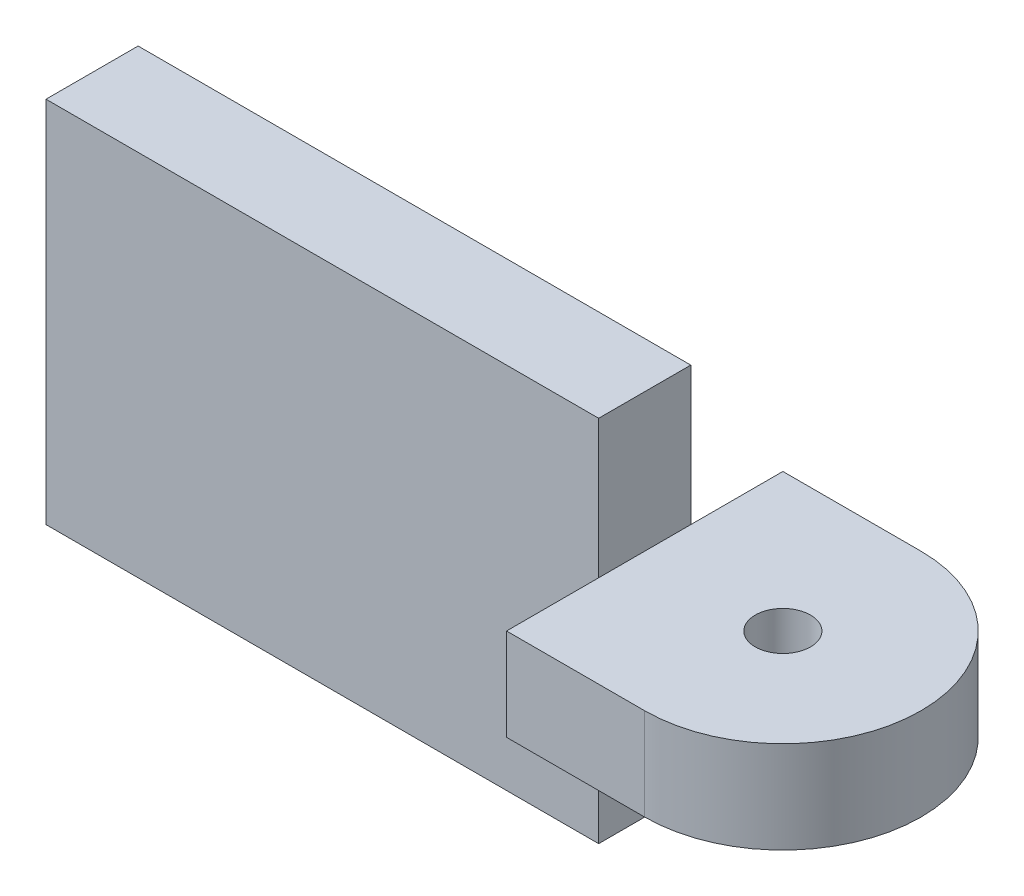
ISO-10303-21;
HEADER;
FILE_DESCRIPTION(('STEP AP214'),'2;1');
FILE_NAME('part.step','',(''),(''),'','','');
FILE_SCHEMA(('AUTOMOTIVE_DESIGN { 1 0 10303 214 1 1 1 1 }'));
ENDSEC;
DATA;
#1=APPLICATION_CONTEXT('core data for automotive mechanical design processes');
#2=APPLICATION_PROTOCOL_DEFINITION('international standard','automotive_design',2000,#1);
#3=PRODUCT_CONTEXT('',#1,'mechanical');
#4=PRODUCT('Part','Part','',(#3));
#5=PRODUCT_RELATED_PRODUCT_CATEGORY('part','',(#4));
#6=PRODUCT_DEFINITION_FORMATION('','',#4);
#7=PRODUCT_DEFINITION_CONTEXT('part definition',#1,'design');
#8=PRODUCT_DEFINITION('design','',#6,#7);
#9=PRODUCT_DEFINITION_SHAPE('','',#8);
#10=(LENGTH_UNIT() NAMED_UNIT(*) SI_UNIT(.MILLI.,.METRE.));
#11=(NAMED_UNIT(*) PLANE_ANGLE_UNIT() SI_UNIT($,.RADIAN.));
#12=(NAMED_UNIT(*) SI_UNIT($,.STERADIAN.) SOLID_ANGLE_UNIT());
#13=UNCERTAINTY_MEASURE_WITH_UNIT(LENGTH_MEASURE(1.E-05),#10,'distance_accuracy_value','');
#14=(GEOMETRIC_REPRESENTATION_CONTEXT(3) GLOBAL_UNCERTAINTY_ASSIGNED_CONTEXT((#13)) GLOBAL_UNIT_ASSIGNED_CONTEXT((#10,
#11,#12)) REPRESENTATION_CONTEXT('',''));
#15=CARTESIAN_POINT('',(0.,0.,0.));
#16=DIRECTION('',(0.,0.,1.));
#17=DIRECTION('',(1.,0.,0.));
#18=AXIS2_PLACEMENT_3D('',#15,#16,#17);
#19=CARTESIAN_POINT('',(7.5,7.5,2.5));
#20=DIRECTION('',(0.,-1.,0.));
#21=DIRECTION('',(1.,0.,0.));
#22=AXIS2_PLACEMENT_3D('',#19,#20,#21);
#23=CYLINDRICAL_SURFACE('',#22,7.5);
#24=DIRECTION('',(0.,-1.,0.));
#25=VECTOR('',#24,1.);
#26=CARTESIAN_POINT('',(7.5,7.5,10.));
#27=LINE('',#26,#25);
#28=CARTESIAN_POINT('',(7.5,7.5,10.));
#29=VERTEX_POINT('',#28);
#30=CARTESIAN_POINT('',(7.5,12.5,10.));
#31=VERTEX_POINT('',#30);
#32=EDGE_CURVE('E96',#29,#31,#27,.F.);
#33=ORIENTED_EDGE('',*,*,#32,.F.);
#34=CARTESIAN_POINT('',(7.5,7.5,2.5));
#35=DIRECTION('',(0.,1.,0.));
#36=DIRECTION('',(-1.,0.,0.));
#37=AXIS2_PLACEMENT_3D('',#34,#35,#36);
#38=CIRCLE('',#37,7.5);
#39=CARTESIAN_POINT('',(7.5,7.5,-5.));
#40=VERTEX_POINT('',#39);
#41=EDGE_CURVE('E57',#40,#29,#38,.F.);
#42=ORIENTED_EDGE('',*,*,#41,.F.);
#43=DIRECTION('',(0.,-1.,0.));
#44=VECTOR('',#43,1.);
#45=CARTESIAN_POINT('',(7.5,7.5,-5.));
#46=LINE('',#45,#44);
#47=CARTESIAN_POINT('',(7.5,12.5,-5.));
#48=VERTEX_POINT('',#47);
#49=EDGE_CURVE('E125',#48,#40,#46,.T.);
#50=ORIENTED_EDGE('',*,*,#49,.F.);
#51=CARTESIAN_POINT('',(7.5,12.5,2.5));
#52=DIRECTION('',(0.,-1.,0.));
#53=DIRECTION('',(1.,0.,0.));
#54=AXIS2_PLACEMENT_3D('',#51,#52,#53);
#55=CIRCLE('',#54,7.5);
#56=EDGE_CURVE('E12',#31,#48,#55,.F.);
#57=ORIENTED_EDGE('',*,*,#56,.F.);
#58=EDGE_LOOP('',(#33,#42,#50,#57));
#59=FACE_BOUND('',#58,.T.);
#60=ADVANCED_FACE('F49',(#59),#23,.T.);
#61=CARTESIAN_POINT('',(15.,7.5,10.));
#62=DIRECTION('',(0.,0.,-1.));
#63=DIRECTION('',(-1.,0.,0.));
#64=AXIS2_PLACEMENT_3D('',#61,#62,#63);
#65=PLANE('',#64);
#66=DIRECTION('',(-1.,0.,0.));
#67=VECTOR('',#66,1.);
#68=CARTESIAN_POINT('',(15.,7.5,10.));
#69=LINE('',#68,#67);
#70=CARTESIAN_POINT('',(0.,7.5,10.));
#71=VERTEX_POINT('',#70);
#72=EDGE_CURVE('E87',#29,#71,#69,.T.);
#73=ORIENTED_EDGE('',*,*,#72,.F.);
#74=ORIENTED_EDGE('',*,*,#32,.T.);
#75=DIRECTION('',(-1.,0.,0.));
#76=VECTOR('',#75,1.);
#77=CARTESIAN_POINT('',(15.,12.5,10.));
#78=LINE('',#77,#76);
#79=CARTESIAN_POINT('',(0.,12.5,10.));
#80=VERTEX_POINT('',#79);
#81=EDGE_CURVE('E108',#31,#80,#78,.T.);
#82=ORIENTED_EDGE('',*,*,#81,.T.);
#83=DIRECTION('',(0.,-1.,0.));
#84=VECTOR('',#83,1.);
#85=CARTESIAN_POINT('',(0.,7.5,10.));
#86=LINE('',#85,#84);
#87=EDGE_CURVE('E103',#80,#71,#86,.T.);
#88=ORIENTED_EDGE('',*,*,#87,.T.);
#89=EDGE_LOOP('',(#73,#74,#82,#88));
#90=FACE_BOUND('',#89,.T.);
#91=ADVANCED_FACE('F107',(#90),#65,.F.);
#92=CARTESIAN_POINT('',(15.,7.5,10.));
#93=DIRECTION('',(0.,1.,0.));
#94=DIRECTION('',(-1.,0.,0.));
#95=AXIS2_PLACEMENT_3D('',#92,#93,#94);
#96=PLANE('',#95);
#97=CARTESIAN_POINT('',(7.5,7.5,2.5));
#98=DIRECTION('',(0.,-1.,0.));
#99=DIRECTION('',(1.,0.,0.));
#100=AXIS2_PLACEMENT_3D('',#97,#98,#99);
#101=CIRCLE('',#100,1.5);
#102=CARTESIAN_POINT('',(9.,7.5,2.5));
#103=VERTEX_POINT('',#102);
#104=EDGE_CURVE('E113',#103,#103,#101,.T.);
#105=ORIENTED_EDGE('',*,*,#104,.F.);
#106=EDGE_LOOP('',(#105));
#107=FACE_BOUND('',#106,.T.);
#108=DIRECTION('',(-1.,0.,0.));
#109=VECTOR('',#108,1.);
#110=CARTESIAN_POINT('',(15.,7.5,-5.));
#111=LINE('',#110,#109);
#112=CARTESIAN_POINT('',(0.,7.5,-5.));
#113=VERTEX_POINT('',#112);
#114=EDGE_CURVE('E97',#40,#113,#111,.T.);
#115=ORIENTED_EDGE('',*,*,#114,.F.);
#116=ORIENTED_EDGE('',*,*,#41,.T.);
#117=ORIENTED_EDGE('',*,*,#72,.T.);
#118=DIRECTION('',(0.,0.,-1.));
#119=VECTOR('',#118,1.);
#120=CARTESIAN_POINT('',(0.,7.5,10.));
#121=LINE('',#120,#119);
#122=EDGE_CURVE('E91',#71,#113,#121,.T.);
#123=ORIENTED_EDGE('',*,*,#122,.T.);
#124=EDGE_LOOP('',(#115,#116,#117,#123));
#125=FACE_BOUND('',#124,.T.);
#126=ADVANCED_FACE('F90',(#107,#125),#96,.F.);
#127=CARTESIAN_POINT('',(15.,7.5,-5.));
#128=DIRECTION('',(0.,0.,1.));
#129=DIRECTION('',(1.,0.,0.));
#130=AXIS2_PLACEMENT_3D('',#127,#128,#129);
#131=PLANE('',#130);
#132=DIRECTION('',(-1.,0.,0.));
#133=VECTOR('',#132,1.);
#134=CARTESIAN_POINT('',(15.,12.5,-5.));
#135=LINE('',#134,#133);
#136=CARTESIAN_POINT('',(0.,12.5,-5.));
#137=VERTEX_POINT('',#136);
#138=EDGE_CURVE('E121',#48,#137,#135,.T.);
#139=ORIENTED_EDGE('',*,*,#138,.F.);
#140=ORIENTED_EDGE('',*,*,#49,.T.);
#141=ORIENTED_EDGE('',*,*,#114,.T.);
#142=DIRECTION('',(0.,1.,0.));
#143=VECTOR('',#142,1.);
#144=CARTESIAN_POINT('',(0.,7.5,-5.));
#145=LINE('',#144,#143);
#146=EDGE_CURVE('E105',#113,#137,#145,.T.);
#147=ORIENTED_EDGE('',*,*,#146,.T.);
#148=EDGE_LOOP('',(#139,#140,#141,#147));
#149=FACE_BOUND('',#148,.T.);
#150=ADVANCED_FACE('F128',(#149),#131,.F.);
#151=CARTESIAN_POINT('',(15.,12.5,10.));
#152=DIRECTION('',(0.,-1.,0.));
#153=DIRECTION('',(1.,0.,0.));
#154=AXIS2_PLACEMENT_3D('',#151,#152,#153);
#155=PLANE('',#154);
#156=CARTESIAN_POINT('',(7.5,12.5,2.5));
#157=DIRECTION('',(0.,-1.,0.));
#158=DIRECTION('',(1.,0.,0.));
#159=AXIS2_PLACEMENT_3D('',#156,#157,#158);
#160=CIRCLE('',#159,1.5);
#161=CARTESIAN_POINT('',(9.,12.5,2.5));
#162=VERTEX_POINT('',#161);
#163=EDGE_CURVE('E110',#162,#162,#160,.T.);
#164=ORIENTED_EDGE('',*,*,#163,.T.);
#165=EDGE_LOOP('',(#164));
#166=FACE_BOUND('',#165,.T.);
#167=ORIENTED_EDGE('',*,*,#81,.F.);
#168=ORIENTED_EDGE('',*,*,#56,.T.);
#169=ORIENTED_EDGE('',*,*,#138,.T.);
#170=DIRECTION('',(0.,0.,1.));
#171=VECTOR('',#170,1.);
#172=CARTESIAN_POINT('',(0.,12.5,10.));
#173=LINE('',#172,#171);
#174=EDGE_CURVE('E118',#137,#80,#173,.T.);
#175=ORIENTED_EDGE('',*,*,#174,.T.);
#176=EDGE_LOOP('',(#167,#168,#169,#175));
#177=FACE_BOUND('',#176,.T.);
#178=ADVANCED_FACE('F129',(#166,#177),#155,.F.);
#179=CARTESIAN_POINT('',(0.,0.,0.));
#180=DIRECTION('',(-1.,0.,0.));
#181=DIRECTION('',(0.,-1.,0.));
#182=AXIS2_PLACEMENT_3D('',#179,#180,#181);
#183=PLANE('',#182);
#184=ORIENTED_EDGE('',*,*,#87,.F.);
#185=ORIENTED_EDGE('',*,*,#174,.F.);
#186=ORIENTED_EDGE('',*,*,#146,.F.);
#187=ORIENTED_EDGE('',*,*,#122,.F.);
#188=EDGE_LOOP('',(#184,#185,#186,#187));
#189=FACE_BOUND('',#188,.T.);
#190=ADVANCED_FACE('F101',(#189),#183,.T.);
#191=CARTESIAN_POINT('',(7.5,12.5,2.5));
#192=DIRECTION('',(0.,-1.,0.));
#193=DIRECTION('',(1.,0.,0.));
#194=AXIS2_PLACEMENT_3D('',#191,#192,#193);
#195=CYLINDRICAL_SURFACE('',#194,1.5);
#196=ORIENTED_EDGE('',*,*,#163,.F.);
#197=EDGE_LOOP('',(#196));
#198=FACE_BOUND('',#197,.T.);
#199=ORIENTED_EDGE('',*,*,#104,.T.);
#200=EDGE_LOOP('',(#199));
#201=FACE_BOUND('',#200,.T.);
#202=ADVANCED_FACE('F137',(#198,#201),#195,.F.);
#203=CLOSED_SHELL('',(#60,#91,#126,#150,#178,#190,#202));
#204=MANIFOLD_SOLID_BREP('B2',#203);
#205=CARTESIAN_POINT('',(0.,0.,5.));
#206=DIRECTION('',(-1.,0.,0.));
#207=DIRECTION('',(0.,-1.,0.));
#208=AXIS2_PLACEMENT_3D('',#205,#206,#207);
#209=PLANE('',#208);
#210=DIRECTION('',(0.,1.,0.));
#211=VECTOR('',#210,1.);
#212=CARTESIAN_POINT('',(0.,0.,0.));
#213=LINE('',#212,#211);
#214=CARTESIAN_POINT('',(0.,0.,0.));
#215=VERTEX_POINT('',#214);
#216=CARTESIAN_POINT('',(0.,20.,0.));
#217=VERTEX_POINT('',#216);
#218=EDGE_CURVE('E260',#215,#217,#213,.T.);
#219=ORIENTED_EDGE('',*,*,#218,.T.);
#220=DIRECTION('',(0.,0.,-1.));
#221=VECTOR('',#220,1.);
#222=CARTESIAN_POINT('',(0.,20.,5.));
#223=LINE('',#222,#221);
#224=CARTESIAN_POINT('',(0.,20.,5.));
#225=VERTEX_POINT('',#224);
#226=EDGE_CURVE('E47',#225,#217,#223,.T.);
#227=ORIENTED_EDGE('',*,*,#226,.F.);
#228=DIRECTION('',(0.,1.,0.));
#229=VECTOR('',#228,1.);
#230=CARTESIAN_POINT('',(0.,0.,5.));
#231=LINE('',#230,#229);
#232=CARTESIAN_POINT('',(0.,0.,5.));
#233=VERTEX_POINT('',#232);
#234=EDGE_CURVE('E248',#233,#225,#231,.T.);
#235=ORIENTED_EDGE('',*,*,#234,.F.);
#236=DIRECTION('',(0.,0.,-1.));
#237=VECTOR('',#236,1.);
#238=CARTESIAN_POINT('',(0.,0.,5.));
#239=LINE('',#238,#237);
#240=EDGE_CURVE('E256',#233,#215,#239,.T.);
#241=ORIENTED_EDGE('',*,*,#240,.T.);
#242=EDGE_LOOP('',(#219,#227,#235,#241));
#243=FACE_BOUND('',#242,.T.);
#244=ADVANCED_FACE('F197',(#243),#209,.F.);
#245=CARTESIAN_POINT('',(0.,20.,5.));
#246=DIRECTION('',(0.,-1.,0.));
#247=DIRECTION('',(1.,0.,0.));
#248=AXIS2_PLACEMENT_3D('',#245,#246,#247);
#249=PLANE('',#248);
#250=DIRECTION('',(-1.,0.,0.));
#251=VECTOR('',#250,1.);
#252=CARTESIAN_POINT('',(0.,20.,0.));
#253=LINE('',#252,#251);
#254=CARTESIAN_POINT('',(-30.,20.,0.));
#255=VERTEX_POINT('',#254);
#256=EDGE_CURVE('E252',#217,#255,#253,.T.);
#257=ORIENTED_EDGE('',*,*,#256,.T.);
#258=DIRECTION('',(0.,0.,-1.));
#259=VECTOR('',#258,1.);
#260=CARTESIAN_POINT('',(-30.,20.,5.));
#261=LINE('',#260,#259);
#262=CARTESIAN_POINT('',(-30.,20.,5.));
#263=VERTEX_POINT('',#262);
#264=EDGE_CURVE('E205',#263,#255,#261,.T.);
#265=ORIENTED_EDGE('',*,*,#264,.F.);
#266=DIRECTION('',(-1.,0.,0.));
#267=VECTOR('',#266,1.);
#268=CARTESIAN_POINT('',(0.,20.,5.));
#269=LINE('',#268,#267);
#270=EDGE_CURVE('E243',#225,#263,#269,.T.);
#271=ORIENTED_EDGE('',*,*,#270,.F.);
#272=ORIENTED_EDGE('',*,*,#226,.T.);
#273=EDGE_LOOP('',(#257,#265,#271,#272));
#274=FACE_BOUND('',#273,.T.);
#275=ADVANCED_FACE('F251',(#274),#249,.F.);
#276=CARTESIAN_POINT('',(-30.,0.,5.));
#277=DIRECTION('',(1.,0.,0.));
#278=DIRECTION('',(0.,0.,-1.));
#279=AXIS2_PLACEMENT_3D('',#276,#277,#278);
#280=PLANE('',#279);
#281=DIRECTION('',(0.,-1.,0.));
#282=VECTOR('',#281,1.);
#283=CARTESIAN_POINT('',(-30.,0.,0.));
#284=LINE('',#283,#282);
#285=CARTESIAN_POINT('',(-30.,0.,0.));
#286=VERTEX_POINT('',#285);
#287=EDGE_CURVE('E230',#255,#286,#284,.T.);
#288=ORIENTED_EDGE('',*,*,#287,.T.);
#289=DIRECTION('',(0.,0.,-1.));
#290=VECTOR('',#289,1.);
#291=CARTESIAN_POINT('',(-30.,0.,5.));
#292=LINE('',#291,#290);
#293=CARTESIAN_POINT('',(-30.,0.,5.));
#294=VERTEX_POINT('',#293);
#295=EDGE_CURVE('E253',#294,#286,#292,.T.);
#296=ORIENTED_EDGE('',*,*,#295,.F.);
#297=DIRECTION('',(0.,-1.,0.));
#298=VECTOR('',#297,1.);
#299=CARTESIAN_POINT('',(-30.,0.,5.));
#300=LINE('',#299,#298);
#301=EDGE_CURVE('E246',#263,#294,#300,.T.);
#302=ORIENTED_EDGE('',*,*,#301,.F.);
#303=ORIENTED_EDGE('',*,*,#264,.T.);
#304=EDGE_LOOP('',(#288,#296,#302,#303));
#305=FACE_BOUND('',#304,.T.);
#306=ADVANCED_FACE('F254',(#305),#280,.F.);
#307=CARTESIAN_POINT('',(0.,0.,5.));
#308=DIRECTION('',(0.,1.,0.));
#309=DIRECTION('',(-1.,0.,0.));
#310=AXIS2_PLACEMENT_3D('',#307,#308,#309);
#311=PLANE('',#310);
#312=DIRECTION('',(1.,0.,0.));
#313=VECTOR('',#312,1.);
#314=CARTESIAN_POINT('',(0.,0.,0.));
#315=LINE('',#314,#313);
#316=EDGE_CURVE('E236',#286,#215,#315,.T.);
#317=ORIENTED_EDGE('',*,*,#316,.T.);
#318=ORIENTED_EDGE('',*,*,#240,.F.);
#319=DIRECTION('',(1.,0.,0.));
#320=VECTOR('',#319,1.);
#321=CARTESIAN_POINT('',(0.,0.,5.));
#322=LINE('',#321,#320);
#323=EDGE_CURVE('E213',#294,#233,#322,.T.);
#324=ORIENTED_EDGE('',*,*,#323,.F.);
#325=ORIENTED_EDGE('',*,*,#295,.T.);
#326=EDGE_LOOP('',(#317,#318,#324,#325));
#327=FACE_BOUND('',#326,.T.);
#328=ADVANCED_FACE('F267',(#327),#311,.F.);
#329=CARTESIAN_POINT('',(0.,0.,5.));
#330=DIRECTION('',(0.,0.,1.));
#331=DIRECTION('',(1.,0.,0.));
#332=AXIS2_PLACEMENT_3D('',#329,#330,#331);
#333=PLANE('',#332);
#334=ORIENTED_EDGE('',*,*,#234,.T.);
#335=ORIENTED_EDGE('',*,*,#270,.T.);
#336=ORIENTED_EDGE('',*,*,#301,.T.);
#337=ORIENTED_EDGE('',*,*,#323,.T.);
#338=EDGE_LOOP('',(#334,#335,#336,#337));
#339=FACE_BOUND('',#338,.T.);
#340=ADVANCED_FACE('F244',(#339),#333,.T.);
#341=CARTESIAN_POINT('',(0.,0.,0.));
#342=DIRECTION('',(0.,0.,1.));
#343=DIRECTION('',(1.,0.,0.));
#344=AXIS2_PLACEMENT_3D('',#341,#342,#343);
#345=PLANE('',#344);
#346=ORIENTED_EDGE('',*,*,#218,.F.);
#347=ORIENTED_EDGE('',*,*,#316,.F.);
#348=ORIENTED_EDGE('',*,*,#287,.F.);
#349=ORIENTED_EDGE('',*,*,#256,.F.);
#350=EDGE_LOOP('',(#346,#347,#348,#349));
#351=FACE_BOUND('',#350,.T.);
#352=ADVANCED_FACE('F270',(#351),#345,.F.);
#353=CLOSED_SHELL('',(#244,#275,#306,#328,#340,#352));
#354=MANIFOLD_SOLID_BREP('B6',#353);
#355=ADVANCED_BREP_SHAPE_REPRESENTATION('',(#18,#204,#354),#14);
#356=SHAPE_DEFINITION_REPRESENTATION(#9,#355);
ENDSEC;
END-ISO-10303-21;
